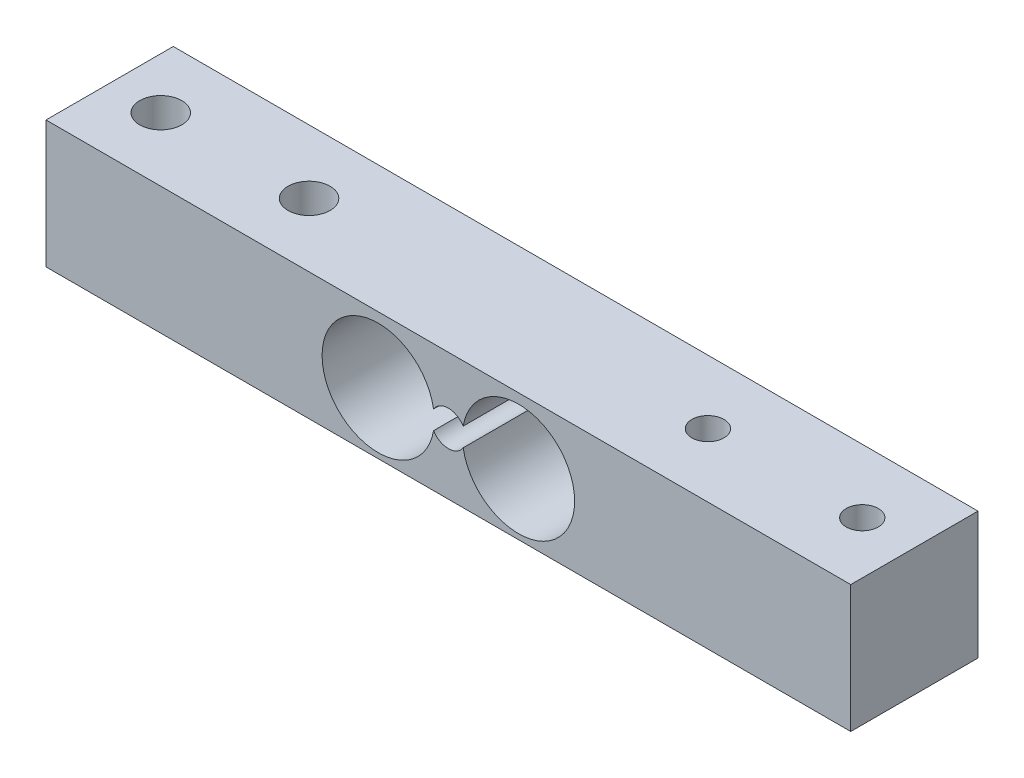
ISO-10303-21;
HEADER;
FILE_DESCRIPTION(('STEP AP214'),'2;1');
FILE_NAME('part.step','',(''),(''),'','','');
FILE_SCHEMA(('AUTOMOTIVE_DESIGN { 1 0 10303 214 1 1 1 1 }'));
ENDSEC;
DATA;
#1=APPLICATION_CONTEXT('core data for automotive mechanical design processes');
#2=APPLICATION_PROTOCOL_DEFINITION('international standard','automotive_design',2000,#1);
#3=PRODUCT_CONTEXT('',#1,'mechanical');
#4=PRODUCT('Part','Part','',(#3));
#5=PRODUCT_RELATED_PRODUCT_CATEGORY('part','',(#4));
#6=PRODUCT_DEFINITION_FORMATION('','',#4);
#7=PRODUCT_DEFINITION_CONTEXT('part definition',#1,'design');
#8=PRODUCT_DEFINITION('design','',#6,#7);
#9=PRODUCT_DEFINITION_SHAPE('','',#8);
#10=(LENGTH_UNIT() NAMED_UNIT(*) SI_UNIT(.MILLI.,.METRE.));
#11=(NAMED_UNIT(*) PLANE_ANGLE_UNIT() SI_UNIT($,.RADIAN.));
#12=(NAMED_UNIT(*) SI_UNIT($,.STERADIAN.) SOLID_ANGLE_UNIT());
#13=UNCERTAINTY_MEASURE_WITH_UNIT(LENGTH_MEASURE(1.E-05),#10,'distance_accuracy_value','');
#14=(GEOMETRIC_REPRESENTATION_CONTEXT(3) GLOBAL_UNCERTAINTY_ASSIGNED_CONTEXT((#13)) GLOBAL_UNIT_ASSIGNED_CONTEXT((#10,
#11,#12)) REPRESENTATION_CONTEXT('',''));
#15=CARTESIAN_POINT('',(0.,0.,0.));
#16=DIRECTION('',(0.,0.,1.));
#17=DIRECTION('',(1.,0.,0.));
#18=AXIS2_PLACEMENT_3D('',#15,#16,#17);
#19=CARTESIAN_POINT('',(0.,12.7,0.));
#20=DIRECTION('',(1.,0.,0.));
#21=DIRECTION('',(0.,0.,-1.));
#22=AXIS2_PLACEMENT_3D('',#19,#20,#21);
#23=PLANE('',#22);
#24=DIRECTION('',(0.,0.,1.));
#25=VECTOR('',#24,1.);
#26=CARTESIAN_POINT('',(0.,0.,0.));
#27=LINE('',#26,#25);
#28=CARTESIAN_POINT('',(0.,0.,0.));
#29=VERTEX_POINT('',#28);
#30=CARTESIAN_POINT('',(0.,0.,12.7));
#31=VERTEX_POINT('',#30);
#32=EDGE_CURVE('E171',#29,#31,#27,.T.);
#33=ORIENTED_EDGE('',*,*,#32,.T.);
#34=DIRECTION('',(0.,-1.,0.));
#35=VECTOR('',#34,1.);
#36=CARTESIAN_POINT('',(0.,12.7,12.7));
#37=LINE('',#36,#35);
#38=CARTESIAN_POINT('',(0.,12.7,12.7));
#39=VERTEX_POINT('',#38);
#40=EDGE_CURVE('E11',#39,#31,#37,.T.);
#41=ORIENTED_EDGE('',*,*,#40,.F.);
#42=DIRECTION('',(0.,0.,1.));
#43=VECTOR('',#42,1.);
#44=CARTESIAN_POINT('',(0.,12.7,0.));
#45=LINE('',#44,#43);
#46=CARTESIAN_POINT('',(0.,12.7,0.));
#47=VERTEX_POINT('',#46);
#48=EDGE_CURVE('E197',#47,#39,#45,.T.);
#49=ORIENTED_EDGE('',*,*,#48,.F.);
#50=DIRECTION('',(0.,-1.,0.));
#51=VECTOR('',#50,1.);
#52=CARTESIAN_POINT('',(0.,12.7,0.));
#53=LINE('',#52,#51);
#54=EDGE_CURVE('E211',#47,#29,#53,.T.);
#55=ORIENTED_EDGE('',*,*,#54,.T.);
#56=EDGE_LOOP('',(#33,#41,#49,#55));
#57=FACE_BOUND('',#56,.T.);
#58=ADVANCED_FACE('F41',(#57),#23,.F.);
#59=CARTESIAN_POINT('',(0.,12.7,12.7));
#60=DIRECTION('',(0.,0.,-1.));
#61=DIRECTION('',(-1.,0.,0.));
#62=AXIS2_PLACEMENT_3D('',#59,#60,#61);
#63=PLANE('',#62);
#64=CARTESIAN_POINT('',(33.15,6.12122931286763,12.7));
#65=DIRECTION('',(0.,0.,1.));
#66=DIRECTION('',(1.,0.,0.));
#67=AXIS2_PLACEMENT_3D('',#64,#65,#66);
#68=CIRCLE('',#67,5.6);
#69=CARTESIAN_POINT('',(38.67125,7.05707034504136,12.7));
#70=VERTEX_POINT('',#69);
#71=CARTESIAN_POINT('',(38.67125,5.1853882806939,12.7));
#72=VERTEX_POINT('',#71);
#73=EDGE_CURVE('E152',#70,#72,#68,.T.);
#74=ORIENTED_EDGE('',*,*,#73,.F.);
#75=CARTESIAN_POINT('',(40.15,6.12122931286763,12.7));
#76=DIRECTION('',(0.,0.,1.));
#77=DIRECTION('',(1.,0.,0.));
#78=AXIS2_PLACEMENT_3D('',#75,#76,#77);
#79=CIRCLE('',#78,1.75);
#80=CARTESIAN_POINT('',(41.62875,7.05707034504136,12.7));
#81=VERTEX_POINT('',#80);
#82=EDGE_CURVE('E59',#81,#70,#79,.T.);
#83=ORIENTED_EDGE('',*,*,#82,.F.);
#84=CARTESIAN_POINT('',(47.15,6.12122931286763,12.7));
#85=DIRECTION('',(0.,0.,1.));
#86=DIRECTION('',(1.,0.,0.));
#87=AXIS2_PLACEMENT_3D('',#84,#85,#86);
#88=CIRCLE('',#87,5.6);
#89=CARTESIAN_POINT('',(41.62875,5.1853882806939,12.7));
#90=VERTEX_POINT('',#89);
#91=EDGE_CURVE('E139',#90,#81,#88,.T.);
#92=ORIENTED_EDGE('',*,*,#91,.F.);
#93=CARTESIAN_POINT('',(40.15,6.12122931286763,12.7));
#94=DIRECTION('',(0.,0.,1.));
#95=DIRECTION('',(1.,0.,0.));
#96=AXIS2_PLACEMENT_3D('',#93,#94,#95);
#97=CIRCLE('',#96,1.75);
#98=EDGE_CURVE('E143',#72,#90,#97,.T.);
#99=ORIENTED_EDGE('',*,*,#98,.F.);
#100=EDGE_LOOP('',(#74,#83,#92,#99));
#101=FACE_BOUND('',#100,.T.);
#102=DIRECTION('',(1.,0.,0.));
#103=VECTOR('',#102,1.);
#104=CARTESIAN_POINT('',(0.,0.,12.7));
#105=LINE('',#104,#103);
#106=CARTESIAN_POINT('',(80.3,0.,12.7));
#107=VERTEX_POINT('',#106);
#108=EDGE_CURVE('E215',#31,#107,#105,.T.);
#109=ORIENTED_EDGE('',*,*,#108,.T.);
#110=DIRECTION('',(0.,-1.,0.));
#111=VECTOR('',#110,1.);
#112=CARTESIAN_POINT('',(80.3,12.7,12.7));
#113=LINE('',#112,#111);
#114=CARTESIAN_POINT('',(80.3,12.7,12.7));
#115=VERTEX_POINT('',#114);
#116=EDGE_CURVE('E49',#115,#107,#113,.T.);
#117=ORIENTED_EDGE('',*,*,#116,.F.);
#118=DIRECTION('',(1.,0.,0.));
#119=VECTOR('',#118,1.);
#120=CARTESIAN_POINT('',(0.,12.7,12.7));
#121=LINE('',#120,#119);
#122=EDGE_CURVE('E201',#39,#115,#121,.T.);
#123=ORIENTED_EDGE('',*,*,#122,.F.);
#124=ORIENTED_EDGE('',*,*,#40,.T.);
#125=EDGE_LOOP('',(#109,#117,#123,#124));
#126=FACE_BOUND('',#125,.T.);
#127=ADVANCED_FACE('F248',(#101,#126),#63,.F.);
#128=CARTESIAN_POINT('',(80.3,12.7,0.));
#129=DIRECTION('',(-1.,0.,0.));
#130=DIRECTION('',(0.,0.,1.));
#131=AXIS2_PLACEMENT_3D('',#128,#129,#130);
#132=PLANE('',#131);
#133=DIRECTION('',(0.,0.,-1.));
#134=VECTOR('',#133,1.);
#135=CARTESIAN_POINT('',(80.3,0.,0.));
#136=LINE('',#135,#134);
#137=CARTESIAN_POINT('',(80.3,0.,0.));
#138=VERTEX_POINT('',#137);
#139=EDGE_CURVE('E218',#107,#138,#136,.T.);
#140=ORIENTED_EDGE('',*,*,#139,.T.);
#141=DIRECTION('',(0.,-1.,0.));
#142=VECTOR('',#141,1.);
#143=CARTESIAN_POINT('',(80.3,12.7,0.));
#144=LINE('',#143,#142);
#145=CARTESIAN_POINT('',(80.3,12.7,0.));
#146=VERTEX_POINT('',#145);
#147=EDGE_CURVE('E225',#146,#138,#144,.T.);
#148=ORIENTED_EDGE('',*,*,#147,.F.);
#149=DIRECTION('',(0.,0.,-1.));
#150=VECTOR('',#149,1.);
#151=CARTESIAN_POINT('',(80.3,12.7,0.));
#152=LINE('',#151,#150);
#153=EDGE_CURVE('E205',#115,#146,#152,.T.);
#154=ORIENTED_EDGE('',*,*,#153,.F.);
#155=ORIENTED_EDGE('',*,*,#116,.T.);
#156=EDGE_LOOP('',(#140,#148,#154,#155));
#157=FACE_BOUND('',#156,.T.);
#158=ADVANCED_FACE('F234',(#157),#132,.F.);
#159=CARTESIAN_POINT('',(0.,12.7,0.));
#160=DIRECTION('',(0.,0.,1.));
#161=DIRECTION('',(1.,0.,0.));
#162=AXIS2_PLACEMENT_3D('',#159,#160,#161);
#163=PLANE('',#162);
#164=CARTESIAN_POINT('',(47.15,6.12122931286763,0.));
#165=DIRECTION('',(0.,0.,1.));
#166=DIRECTION('',(1.,0.,0.));
#167=AXIS2_PLACEMENT_3D('',#164,#165,#166);
#168=CIRCLE('',#167,5.6);
#169=CARTESIAN_POINT('',(41.62875,5.1853882806939,0.));
#170=VERTEX_POINT('',#169);
#171=CARTESIAN_POINT('',(41.62875,7.05707034504136,0.));
#172=VERTEX_POINT('',#171);
#173=EDGE_CURVE('E127',#170,#172,#168,.T.);
#174=ORIENTED_EDGE('',*,*,#173,.T.);
#175=CARTESIAN_POINT('',(40.15,6.12122931286763,0.));
#176=DIRECTION('',(0.,0.,1.));
#177=DIRECTION('',(1.,0.,0.));
#178=AXIS2_PLACEMENT_3D('',#175,#176,#177);
#179=CIRCLE('',#178,1.75);
#180=CARTESIAN_POINT('',(38.67125,7.05707034504136,0.));
#181=VERTEX_POINT('',#180);
#182=EDGE_CURVE('E120',#172,#181,#179,.T.);
#183=ORIENTED_EDGE('',*,*,#182,.T.);
#184=CARTESIAN_POINT('',(33.15,6.12122931286763,0.));
#185=DIRECTION('',(0.,0.,1.));
#186=DIRECTION('',(1.,0.,0.));
#187=AXIS2_PLACEMENT_3D('',#184,#185,#186);
#188=CIRCLE('',#187,5.6);
#189=CARTESIAN_POINT('',(38.67125,5.1853882806939,0.));
#190=VERTEX_POINT('',#189);
#191=EDGE_CURVE('E130',#181,#190,#188,.T.);
#192=ORIENTED_EDGE('',*,*,#191,.T.);
#193=CARTESIAN_POINT('',(40.15,6.12122931286763,0.));
#194=DIRECTION('',(0.,0.,1.));
#195=DIRECTION('',(1.,0.,0.));
#196=AXIS2_PLACEMENT_3D('',#193,#194,#195);
#197=CIRCLE('',#196,1.75);
#198=EDGE_CURVE('E70',#190,#170,#197,.T.);
#199=ORIENTED_EDGE('',*,*,#198,.T.);
#200=EDGE_LOOP('',(#174,#183,#192,#199));
#201=FACE_BOUND('',#200,.T.);
#202=DIRECTION('',(-1.,0.,0.));
#203=VECTOR('',#202,1.);
#204=CARTESIAN_POINT('',(0.,0.,0.));
#205=LINE('',#204,#203);
#206=EDGE_CURVE('E202',#138,#29,#205,.T.);
#207=ORIENTED_EDGE('',*,*,#206,.T.);
#208=ORIENTED_EDGE('',*,*,#54,.F.);
#209=DIRECTION('',(-1.,0.,0.));
#210=VECTOR('',#209,1.);
#211=CARTESIAN_POINT('',(0.,12.7,0.));
#212=LINE('',#211,#210);
#213=EDGE_CURVE('E208',#146,#47,#212,.T.);
#214=ORIENTED_EDGE('',*,*,#213,.F.);
#215=ORIENTED_EDGE('',*,*,#147,.T.);
#216=EDGE_LOOP('',(#207,#208,#214,#215));
#217=FACE_BOUND('',#216,.T.);
#218=ADVANCED_FACE('F135',(#201,#217),#163,.F.);
#219=CARTESIAN_POINT('',(0.,12.7,0.));
#220=DIRECTION('',(0.,1.,0.));
#221=DIRECTION('',(0.,0.,1.));
#222=AXIS2_PLACEMENT_3D('',#219,#220,#221);
#223=PLANE('',#222);
#224=CARTESIAN_POINT('',(5.1,12.7,6.35));
#225=DIRECTION('',(0.,1.,0.));
#226=DIRECTION('',(0.,0.,1.));
#227=AXIS2_PLACEMENT_3D('',#224,#225,#226);
#228=CIRCLE('',#227,2.1);
#229=CARTESIAN_POINT('',(5.1,12.7,8.45));
#230=VERTEX_POINT('',#229);
#231=EDGE_CURVE('E172',#230,#230,#228,.T.);
#232=ORIENTED_EDGE('',*,*,#231,.F.);
#233=EDGE_LOOP('',(#232));
#234=FACE_BOUND('',#233,.T.);
#235=CARTESIAN_POINT('',(19.9,12.7,6.35));
#236=DIRECTION('',(0.,1.,0.));
#237=DIRECTION('',(0.,0.,1.));
#238=AXIS2_PLACEMENT_3D('',#235,#236,#237);
#239=CIRCLE('',#238,2.1);
#240=CARTESIAN_POINT('',(19.9,12.7,8.45));
#241=VERTEX_POINT('',#240);
#242=EDGE_CURVE('E180',#241,#241,#239,.T.);
#243=ORIENTED_EDGE('',*,*,#242,.F.);
#244=EDGE_LOOP('',(#243));
#245=FACE_BOUND('',#244,.T.);
#246=CARTESIAN_POINT('',(59.7,12.7,6.35));
#247=DIRECTION('',(0.,1.,0.));
#248=DIRECTION('',(0.,0.,1.));
#249=AXIS2_PLACEMENT_3D('',#246,#247,#248);
#250=CIRCLE('',#249,1.60000000000001);
#251=CARTESIAN_POINT('',(59.7,12.7,7.95000000000001));
#252=VERTEX_POINT('',#251);
#253=EDGE_CURVE('E187',#252,#252,#250,.T.);
#254=ORIENTED_EDGE('',*,*,#253,.F.);
#255=EDGE_LOOP('',(#254));
#256=FACE_BOUND('',#255,.T.);
#257=CARTESIAN_POINT('',(75.1,12.7,6.35));
#258=DIRECTION('',(0.,1.,0.));
#259=DIRECTION('',(0.,0.,1.));
#260=AXIS2_PLACEMENT_3D('',#257,#258,#259);
#261=CIRCLE('',#260,1.60000000000001);
#262=CARTESIAN_POINT('',(75.1,12.7,7.95000000000001));
#263=VERTEX_POINT('',#262);
#264=EDGE_CURVE('E161',#263,#263,#261,.T.);
#265=ORIENTED_EDGE('',*,*,#264,.F.);
#266=EDGE_LOOP('',(#265));
#267=FACE_BOUND('',#266,.T.);
#268=ORIENTED_EDGE('',*,*,#48,.T.);
#269=ORIENTED_EDGE('',*,*,#122,.T.);
#270=ORIENTED_EDGE('',*,*,#153,.T.);
#271=ORIENTED_EDGE('',*,*,#213,.T.);
#272=EDGE_LOOP('',(#268,#269,#270,#271));
#273=FACE_BOUND('',#272,.T.);
#274=ADVANCED_FACE('F247',(#234,#245,#256,#267,#273),#223,.T.);
#275=CARTESIAN_POINT('',(0.,0.,0.));
#276=DIRECTION('',(0.,1.,0.));
#277=DIRECTION('',(0.,0.,1.));
#278=AXIS2_PLACEMENT_3D('',#275,#276,#277);
#279=PLANE('',#278);
#280=CARTESIAN_POINT('',(5.1,0.,6.35));
#281=DIRECTION('',(0.,1.,0.));
#282=DIRECTION('',(0.,0.,1.));
#283=AXIS2_PLACEMENT_3D('',#280,#281,#282);
#284=CIRCLE('',#283,2.1);
#285=CARTESIAN_POINT('',(5.1,0.,8.45));
#286=VERTEX_POINT('',#285);
#287=EDGE_CURVE('E167',#286,#286,#284,.T.);
#288=ORIENTED_EDGE('',*,*,#287,.T.);
#289=EDGE_LOOP('',(#288));
#290=FACE_BOUND('',#289,.T.);
#291=CARTESIAN_POINT('',(19.9,0.,6.35));
#292=DIRECTION('',(0.,1.,0.));
#293=DIRECTION('',(0.,0.,1.));
#294=AXIS2_PLACEMENT_3D('',#291,#292,#293);
#295=CIRCLE('',#294,2.1);
#296=CARTESIAN_POINT('',(19.9,0.,8.45));
#297=VERTEX_POINT('',#296);
#298=EDGE_CURVE('E176',#297,#297,#295,.T.);
#299=ORIENTED_EDGE('',*,*,#298,.T.);
#300=EDGE_LOOP('',(#299));
#301=FACE_BOUND('',#300,.T.);
#302=CARTESIAN_POINT('',(59.7,0.,6.35));
#303=DIRECTION('',(0.,1.,0.));
#304=DIRECTION('',(0.,0.,1.));
#305=AXIS2_PLACEMENT_3D('',#302,#303,#304);
#306=CIRCLE('',#305,1.60000000000001);
#307=CARTESIAN_POINT('',(59.7,0.,7.95000000000001));
#308=VERTEX_POINT('',#307);
#309=EDGE_CURVE('E184',#308,#308,#306,.T.);
#310=ORIENTED_EDGE('',*,*,#309,.T.);
#311=EDGE_LOOP('',(#310));
#312=FACE_BOUND('',#311,.T.);
#313=CARTESIAN_POINT('',(75.1,0.,6.35));
#314=DIRECTION('',(0.,1.,0.));
#315=DIRECTION('',(0.,0.,1.));
#316=AXIS2_PLACEMENT_3D('',#313,#314,#315);
#317=CIRCLE('',#316,1.60000000000001);
#318=CARTESIAN_POINT('',(75.1,0.,7.95000000000001));
#319=VERTEX_POINT('',#318);
#320=EDGE_CURVE('E191',#319,#319,#317,.T.);
#321=ORIENTED_EDGE('',*,*,#320,.T.);
#322=EDGE_LOOP('',(#321));
#323=FACE_BOUND('',#322,.T.);
#324=ORIENTED_EDGE('',*,*,#32,.F.);
#325=ORIENTED_EDGE('',*,*,#206,.F.);
#326=ORIENTED_EDGE('',*,*,#139,.F.);
#327=ORIENTED_EDGE('',*,*,#108,.F.);
#328=EDGE_LOOP('',(#324,#325,#326,#327));
#329=FACE_BOUND('',#328,.T.);
#330=ADVANCED_FACE('F240',(#290,#301,#312,#323,#329),#279,.F.);
#331=CARTESIAN_POINT('',(75.1,0.,6.35));
#332=DIRECTION('',(0.,1.,0.));
#333=DIRECTION('',(0.,0.,1.));
#334=AXIS2_PLACEMENT_3D('',#331,#332,#333);
#335=CYLINDRICAL_SURFACE('',#334,1.60000000000001);
#336=ORIENTED_EDGE('',*,*,#320,.F.);
#337=EDGE_LOOP('',(#336));
#338=FACE_BOUND('',#337,.T.);
#339=ORIENTED_EDGE('',*,*,#264,.T.);
#340=EDGE_LOOP('',(#339));
#341=FACE_BOUND('',#340,.T.);
#342=ADVANCED_FACE('F261',(#338,#341),#335,.F.);
#343=CARTESIAN_POINT('',(59.7,0.,6.35));
#344=DIRECTION('',(0.,1.,0.));
#345=DIRECTION('',(0.,0.,1.));
#346=AXIS2_PLACEMENT_3D('',#343,#344,#345);
#347=CYLINDRICAL_SURFACE('',#346,1.60000000000001);
#348=ORIENTED_EDGE('',*,*,#309,.F.);
#349=EDGE_LOOP('',(#348));
#350=FACE_BOUND('',#349,.T.);
#351=ORIENTED_EDGE('',*,*,#253,.T.);
#352=EDGE_LOOP('',(#351));
#353=FACE_BOUND('',#352,.T.);
#354=ADVANCED_FACE('F268',(#350,#353),#347,.F.);
#355=CARTESIAN_POINT('',(19.9,0.,6.35));
#356=DIRECTION('',(0.,1.,0.));
#357=DIRECTION('',(0.,0.,1.));
#358=AXIS2_PLACEMENT_3D('',#355,#356,#357);
#359=CYLINDRICAL_SURFACE('',#358,2.1);
#360=ORIENTED_EDGE('',*,*,#298,.F.);
#361=EDGE_LOOP('',(#360));
#362=FACE_BOUND('',#361,.T.);
#363=ORIENTED_EDGE('',*,*,#242,.T.);
#364=EDGE_LOOP('',(#363));
#365=FACE_BOUND('',#364,.T.);
#366=ADVANCED_FACE('F272',(#362,#365),#359,.F.);
#367=CARTESIAN_POINT('',(5.1,0.,6.35));
#368=DIRECTION('',(0.,1.,0.));
#369=DIRECTION('',(0.,0.,1.));
#370=AXIS2_PLACEMENT_3D('',#367,#368,#369);
#371=CYLINDRICAL_SURFACE('',#370,2.1);
#372=ORIENTED_EDGE('',*,*,#287,.F.);
#373=EDGE_LOOP('',(#372));
#374=FACE_BOUND('',#373,.T.);
#375=ORIENTED_EDGE('',*,*,#231,.T.);
#376=EDGE_LOOP('',(#375));
#377=FACE_BOUND('',#376,.T.);
#378=ADVANCED_FACE('F276',(#374,#377),#371,.F.);
#379=CARTESIAN_POINT('',(40.15,6.12122931286763,0.));
#380=DIRECTION('',(0.,0.,1.));
#381=DIRECTION('',(1.,0.,0.));
#382=AXIS2_PLACEMENT_3D('',#379,#380,#381);
#383=CYLINDRICAL_SURFACE('',#382,1.75);
#384=ORIENTED_EDGE('',*,*,#82,.T.);
#385=DIRECTION('',(0.,0.,1.));
#386=VECTOR('',#385,1.);
#387=CARTESIAN_POINT('',(38.67125,7.05707034504136,0.));
#388=LINE('',#387,#386);
#389=EDGE_CURVE('E116',#181,#70,#388,.T.);
#390=ORIENTED_EDGE('',*,*,#389,.F.);
#391=ORIENTED_EDGE('',*,*,#182,.F.);
#392=DIRECTION('',(0.,0.,1.));
#393=VECTOR('',#392,1.);
#394=CARTESIAN_POINT('',(41.62875,7.05707034504136,0.));
#395=LINE('',#394,#393);
#396=EDGE_CURVE('E158',#172,#81,#395,.T.);
#397=ORIENTED_EDGE('',*,*,#396,.T.);
#398=EDGE_LOOP('',(#384,#390,#391,#397));
#399=FACE_BOUND('',#398,.T.);
#400=ADVANCED_FACE('F118',(#399),#383,.F.);
#401=CARTESIAN_POINT('',(47.15,6.12122931286763,0.));
#402=DIRECTION('',(0.,0.,1.));
#403=DIRECTION('',(1.,0.,0.));
#404=AXIS2_PLACEMENT_3D('',#401,#402,#403);
#405=CYLINDRICAL_SURFACE('',#404,5.6);
#406=ORIENTED_EDGE('',*,*,#91,.T.);
#407=ORIENTED_EDGE('',*,*,#396,.F.);
#408=ORIENTED_EDGE('',*,*,#173,.F.);
#409=DIRECTION('',(0.,0.,1.));
#410=VECTOR('',#409,1.);
#411=CARTESIAN_POINT('',(41.62875,5.1853882806939,0.));
#412=LINE('',#411,#410);
#413=EDGE_CURVE('E162',#170,#90,#412,.T.);
#414=ORIENTED_EDGE('',*,*,#413,.T.);
#415=EDGE_LOOP('',(#406,#407,#408,#414));
#416=FACE_BOUND('',#415,.T.);
#417=ADVANCED_FACE('F283',(#416),#405,.F.);
#418=CARTESIAN_POINT('',(40.15,6.12122931286763,0.));
#419=DIRECTION('',(0.,0.,1.));
#420=DIRECTION('',(1.,0.,0.));
#421=AXIS2_PLACEMENT_3D('',#418,#419,#420);
#422=CYLINDRICAL_SURFACE('',#421,1.75);
#423=ORIENTED_EDGE('',*,*,#98,.T.);
#424=ORIENTED_EDGE('',*,*,#413,.F.);
#425=ORIENTED_EDGE('',*,*,#198,.F.);
#426=DIRECTION('',(0.,0.,1.));
#427=VECTOR('',#426,1.);
#428=CARTESIAN_POINT('',(38.67125,5.1853882806939,0.));
#429=LINE('',#428,#427);
#430=EDGE_CURVE('E126',#190,#72,#429,.T.);
#431=ORIENTED_EDGE('',*,*,#430,.T.);
#432=EDGE_LOOP('',(#423,#424,#425,#431));
#433=FACE_BOUND('',#432,.T.);
#434=ADVANCED_FACE('F286',(#433),#422,.F.);
#435=CARTESIAN_POINT('',(33.15,6.12122931286763,0.));
#436=DIRECTION('',(0.,0.,1.));
#437=DIRECTION('',(1.,0.,0.));
#438=AXIS2_PLACEMENT_3D('',#435,#436,#437);
#439=CYLINDRICAL_SURFACE('',#438,5.6);
#440=ORIENTED_EDGE('',*,*,#73,.T.);
#441=ORIENTED_EDGE('',*,*,#430,.F.);
#442=ORIENTED_EDGE('',*,*,#191,.F.);
#443=ORIENTED_EDGE('',*,*,#389,.T.);
#444=EDGE_LOOP('',(#440,#441,#442,#443));
#445=FACE_BOUND('',#444,.T.);
#446=ADVANCED_FACE('F131',(#445),#439,.F.);
#447=CLOSED_SHELL('',(#58,#127,#158,#218,#274,#330,#342,#354,#366,#378,#400,#417,#434,#446));
#448=MANIFOLD_SOLID_BREP('B2',#447);
#449=ADVANCED_BREP_SHAPE_REPRESENTATION('',(#18,#448),#14);
#450=SHAPE_DEFINITION_REPRESENTATION(#9,#449);
ENDSEC;
END-ISO-10303-21;
